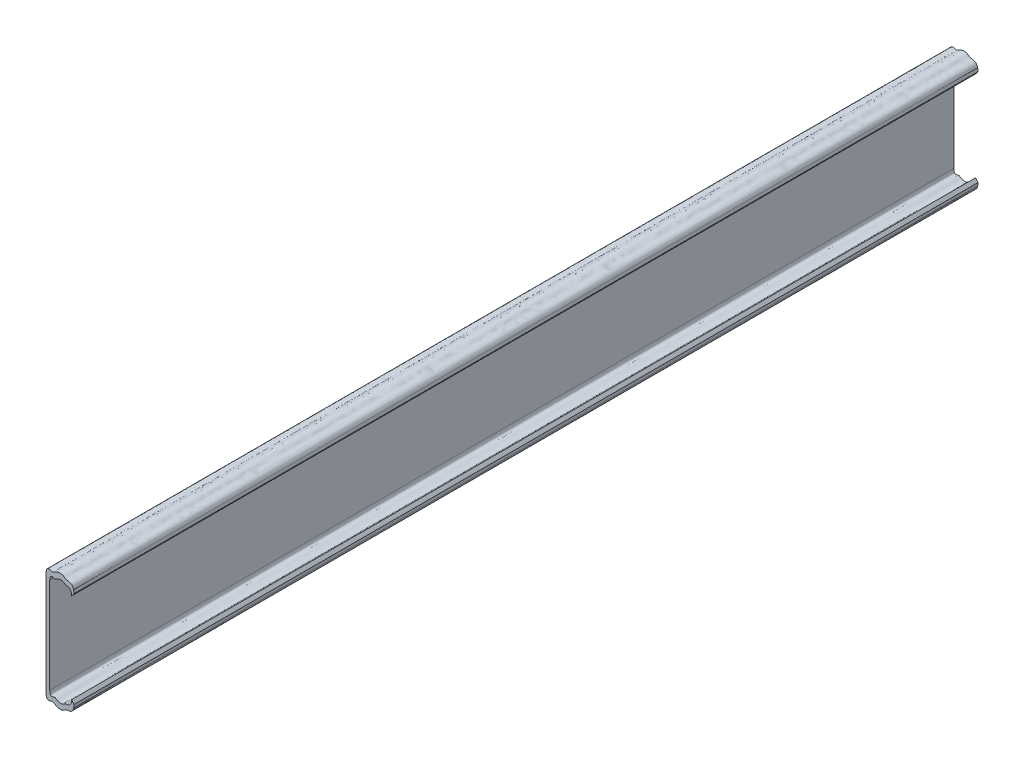
ISO-10303-21;
HEADER;
FILE_DESCRIPTION(('STEP AP214'),'2;1');
FILE_NAME('part.step','',(''),(''),'','','');
FILE_SCHEMA(('AUTOMOTIVE_DESIGN { 1 0 10303 214 1 1 1 1 }'));
ENDSEC;
DATA;
#1=APPLICATION_CONTEXT('core data for automotive mechanical design processes');
#2=APPLICATION_PROTOCOL_DEFINITION('international standard','automotive_design',2000,#1);
#3=PRODUCT_CONTEXT('',#1,'mechanical');
#4=PRODUCT('Part','Part','',(#3));
#5=PRODUCT_RELATED_PRODUCT_CATEGORY('part','',(#4));
#6=PRODUCT_DEFINITION_FORMATION('','',#4);
#7=PRODUCT_DEFINITION_CONTEXT('part definition',#1,'design');
#8=PRODUCT_DEFINITION('design','',#6,#7);
#9=PRODUCT_DEFINITION_SHAPE('','',#8);
#10=(LENGTH_UNIT() NAMED_UNIT(*) SI_UNIT(.MILLI.,.METRE.));
#11=(NAMED_UNIT(*) PLANE_ANGLE_UNIT() SI_UNIT($,.RADIAN.));
#12=(NAMED_UNIT(*) SI_UNIT($,.STERADIAN.) SOLID_ANGLE_UNIT());
#13=UNCERTAINTY_MEASURE_WITH_UNIT(LENGTH_MEASURE(1.E-05),#10,'distance_accuracy_value','');
#14=(GEOMETRIC_REPRESENTATION_CONTEXT(3) GLOBAL_UNCERTAINTY_ASSIGNED_CONTEXT((#13)) GLOBAL_UNIT_ASSIGNED_CONTEXT((#10,
#11,#12)) REPRESENTATION_CONTEXT('',''));
#15=CARTESIAN_POINT('',(0.,0.,0.));
#16=DIRECTION('',(0.,0.,1.));
#17=DIRECTION('',(1.,0.,0.));
#18=AXIS2_PLACEMENT_3D('',#15,#16,#17);
#19=CARTESIAN_POINT('',(1.4303438781,3954.7290134696,346.));
#20=CARTESIAN_POINT('',(1.49225374384663,3955.77746448599,346.));
#21=CARTESIAN_POINT('',(1.67074265915312,3956.0853036269,346.));
#22=CARTESIAN_POINT('',(1.95280531093384,3956.24341615377,346.));
#23=CARTESIAN_POINT('',(2.01218805764632,3956.26460522119,346.));
#24=CARTESIAN_POINT('',(2.25690998711431,3956.32860316862,346.));
#25=CARTESIAN_POINT('',(2.45639926607912,3956.32067254284,346.));
#26=CARTESIAN_POINT('',(2.75790433869258,3956.25941486374,346.));
#27=CARTESIAN_POINT('',(2.86747597615551,3956.22053986312,346.));
#28=CARTESIAN_POINT('',(3.06558290014947,3956.14222097741,346.));
#29=CARTESIAN_POINT('',(3.15726891049071,3956.10455305321,346.));
#30=CARTESIAN_POINT('',(3.35300276320374,3956.0750713278,346.));
#31=CARTESIAN_POINT('',(3.4575650783039,3956.08480291435,346.));
#32=CARTESIAN_POINT('',(3.82696295161048,3956.23664140706,346.));
#33=CARTESIAN_POINT('',(4.13936718021687,3956.47693410221,346.));
#34=CARTESIAN_POINT('',(4.67975367585937,3956.73244660637,346.));
#35=CARTESIAN_POINT('',(4.87237531123399,3956.79870044436,346.));
#36=CARTESIAN_POINT('',(5.25945523692549,3956.89126990318,346.));
#37=CARTESIAN_POINT('',(5.45387712524793,3956.91768379151,346.));
#38=CARTESIAN_POINT('',(5.82111238319273,3956.92926877996,346.));
#39=CARTESIAN_POINT('',(5.99223886047815,3956.91358975771,346.));
#40=CARTESIAN_POINT('',(6.38080961523541,3956.8295198748,346.));
#41=CARTESIAN_POINT('',(6.58050411269036,3956.73963673266,346.));
#42=CARTESIAN_POINT('',(6.80082064641727,3956.58965072797,346.));
#43=CARTESIAN_POINT('',(6.85125983036742,3956.54949734534,346.));
#44=CARTESIAN_POINT('',(7.05761493562505,3956.38491741419,346.));
#45=CARTESIAN_POINT('',(7.22447398202123,3956.25287029291,346.));
#46=CARTESIAN_POINT('',(7.69412707282574,3956.12932011518,346.));
#47=CARTESIAN_POINT('',(7.83348973176185,3956.10436346912,346.));
#48=CARTESIAN_POINT('',(7.99665305390573,3956.0818615527,346.));
#49=B_SPLINE_CURVE_WITH_KNOTS('',3,(#19,#20,#21,#22,#23,#24,#25,#26,#27,#28,#29,#30,#31,#32,#33,
#34,#35,#36,#37,#38,#39,#40,#41,#42,#43,#44,#45,#46,#47,#48),.UNSPECIFIED.,.F.,.F.,(4,2,2,2,2,2,
2,2,2,2,2,2,2,2,4),(0.,0.124999999999758,0.156249999999776,0.24999999999983,0.312499999999866,
0.374999999999902,0.437499999999938,0.56250000000001,0.625000000000046,0.687500000000082,
0.750000000000118,0.843750000000172,0.875000000000189,0.968750000000047,1.),.UNSPECIFIED.);
#50=DIRECTION('',(0.,0.,-1.));
#51=VECTOR('',#50,1.);
#52=SURFACE_OF_LINEAR_EXTRUSION('',#49,#51);
#53=CARTESIAN_POINT('',(1.4303438781,3954.7290134696,0.));
#54=CARTESIAN_POINT('',(1.49225374384663,3955.77746448599,0.));
#55=CARTESIAN_POINT('',(1.67074265915312,3956.0853036269,0.));
#56=CARTESIAN_POINT('',(1.95280531093384,3956.24341615377,0.));
#57=CARTESIAN_POINT('',(2.01218805764632,3956.26460522119,0.));
#58=CARTESIAN_POINT('',(2.25690998711431,3956.32860316862,0.));
#59=CARTESIAN_POINT('',(2.45639926607912,3956.32067254284,0.));
#60=CARTESIAN_POINT('',(2.75790433869258,3956.25941486374,0.));
#61=CARTESIAN_POINT('',(2.86747597615551,3956.22053986312,0.));
#62=CARTESIAN_POINT('',(3.06558290014947,3956.14222097741,0.));
#63=CARTESIAN_POINT('',(3.15726891049071,3956.10455305321,0.));
#64=CARTESIAN_POINT('',(3.35300276320374,3956.0750713278,0.));
#65=CARTESIAN_POINT('',(3.4575650783039,3956.08480291435,0.));
#66=CARTESIAN_POINT('',(3.82696295161048,3956.23664140706,0.));
#67=CARTESIAN_POINT('',(4.13936718021687,3956.47693410221,0.));
#68=CARTESIAN_POINT('',(4.67975367585937,3956.73244660637,0.));
#69=CARTESIAN_POINT('',(4.87237531123399,3956.79870044436,0.));
#70=CARTESIAN_POINT('',(5.25945523692549,3956.89126990318,0.));
#71=CARTESIAN_POINT('',(5.45387712524793,3956.91768379151,0.));
#72=CARTESIAN_POINT('',(5.82111238319273,3956.92926877996,0.));
#73=CARTESIAN_POINT('',(5.99223886047815,3956.91358975771,0.));
#74=CARTESIAN_POINT('',(6.38080961523541,3956.8295198748,0.));
#75=CARTESIAN_POINT('',(6.58050411269036,3956.73963673266,0.));
#76=CARTESIAN_POINT('',(6.80082064641727,3956.58965072797,0.));
#77=CARTESIAN_POINT('',(6.85125983036742,3956.54949734534,0.));
#78=CARTESIAN_POINT('',(7.05761493562505,3956.38491741419,0.));
#79=CARTESIAN_POINT('',(7.22447398202123,3956.25287029291,0.));
#80=CARTESIAN_POINT('',(7.69412707282574,3956.12932011518,0.));
#81=CARTESIAN_POINT('',(7.83348973176185,3956.10436346912,0.));
#82=CARTESIAN_POINT('',(7.99665305390573,3956.0818615527,0.));
#83=B_SPLINE_CURVE_WITH_KNOTS('',3,(#53,#54,#55,#56,#57,#58,#59,#60,#61,#62,#63,#64,#65,#66,#67,
#68,#69,#70,#71,#72,#73,#74,#75,#76,#77,#78,#79,#80,#81,#82),.UNSPECIFIED.,.F.,.F.,(4,2,2,2,2,2,
2,2,2,2,2,2,2,2,4),(0.,0.124999999999758,0.156249999999776,0.24999999999983,0.312499999999866,
0.374999999999902,0.437499999999938,0.56250000000001,0.625000000000046,0.687500000000082,
0.750000000000118,0.843750000000172,0.875000000000189,0.968750000000047,1.),.UNSPECIFIED.);
#84=CARTESIAN_POINT('',(1.4303438781,3954.7290134696,0.));
#85=VERTEX_POINT('',#84);
#86=CARTESIAN_POINT('',(7.99665305390573,3956.0818615527,0.));
#87=VERTEX_POINT('',#86);
#88=EDGE_CURVE('E312',#85,#87,#83,.T.);
#89=ORIENTED_EDGE('',*,*,#88,.T.);
#90=DIRECTION('',(0.,0.,-1.));
#91=VECTOR('',#90,1.);
#92=CARTESIAN_POINT('',(7.99665305390573,3956.0818615527,346.));
#93=LINE('',#92,#91);
#94=CARTESIAN_POINT('',(7.99665305390573,3956.0818615527,346.));
#95=VERTEX_POINT('',#94);
#96=EDGE_CURVE('E11',#95,#87,#93,.T.);
#97=ORIENTED_EDGE('',*,*,#96,.F.);
#98=CARTESIAN_POINT('',(1.4303438781,3954.7290134696,346.));
#99=VERTEX_POINT('',#98);
#100=EDGE_CURVE('E246',#99,#95,#49,.T.);
#101=ORIENTED_EDGE('',*,*,#100,.F.);
#102=DIRECTION('',(0.,0.,-1.));
#103=VECTOR('',#102,1.);
#104=CARTESIAN_POINT('',(1.4303438781,3954.7290134696,346.));
#105=LINE('',#104,#103);
#106=EDGE_CURVE('E158',#99,#85,#105,.T.);
#107=ORIENTED_EDGE('',*,*,#106,.T.);
#108=EDGE_LOOP('',(#89,#97,#101,#107));
#109=FACE_BOUND('',#108,.T.);
#110=ADVANCED_FACE('F41',(#109),#52,.F.);
#111=CARTESIAN_POINT('',(7.99665305390573,3956.0818615527,346.));
#112=CARTESIAN_POINT('',(8.08813068826407,3956.0693209082,346.));
#113=CARTESIAN_POINT('',(8.27275941401864,3956.04401020543,346.));
#114=CARTESIAN_POINT('',(8.54804329715297,3955.98416982031,346.));
#115=CARTESIAN_POINT('',(8.80734903983867,3955.88761999486,346.));
#116=CARTESIAN_POINT('',(9.1144343791744,3955.70596587339,346.));
#117=CARTESIAN_POINT('',(9.39349914253424,3955.39517867725,346.));
#118=CARTESIAN_POINT('',(9.58119185863487,3954.99385688315,346.));
#119=CARTESIAN_POINT('',(9.6679937161165,3954.67444356862,346.));
#120=CARTESIAN_POINT('',(9.71301303772911,3954.43205680597,346.));
#121=CARTESIAN_POINT('',(9.74377818261847,3954.20996294607,346.));
#122=CARTESIAN_POINT('',(9.76600800121297,3953.93847563136,346.));
#123=CARTESIAN_POINT('',(9.77000773691653,3953.75199828866,346.));
#124=CARTESIAN_POINT('',(9.77215865061568,3953.65171749494,346.));
#125=B_SPLINE_CURVE_WITH_KNOTS('',3,(#111,#112,#113,#114,#115,#116,#117,#118,#119,#120,#121,
#122,#123,#124),.UNSPECIFIED.,.F.,.F.,(4,1,1,1,1,1,1,1,1,1,1,4),(0.,0.060950833195839,
0.123016677743811,0.186644705279015,0.24715033662554,0.37168747916435,0.497525342586824,
0.623449375183771,0.683912365851527,0.749156721838359,0.865105526133175,1.),.UNSPECIFIED.);
#126=DIRECTION('',(0.,0.,-1.));
#127=VECTOR('',#126,1.);
#128=SURFACE_OF_LINEAR_EXTRUSION('',#125,#127);
#129=CARTESIAN_POINT('',(7.99665305390573,3956.0818615527,0.));
#130=CARTESIAN_POINT('',(8.08813068826407,3956.0693209082,0.));
#131=CARTESIAN_POINT('',(8.27275941401864,3956.04401020543,0.));
#132=CARTESIAN_POINT('',(8.54804329715297,3955.98416982031,0.));
#133=CARTESIAN_POINT('',(8.80734903983867,3955.88761999486,0.));
#134=CARTESIAN_POINT('',(9.1144343791744,3955.70596587339,0.));
#135=CARTESIAN_POINT('',(9.39349914253424,3955.39517867725,0.));
#136=CARTESIAN_POINT('',(9.58119185863487,3954.99385688315,0.));
#137=CARTESIAN_POINT('',(9.6679937161165,3954.67444356862,0.));
#138=CARTESIAN_POINT('',(9.71301303772911,3954.43205680597,0.));
#139=CARTESIAN_POINT('',(9.74377818261847,3954.20996294607,0.));
#140=CARTESIAN_POINT('',(9.76600800121297,3953.93847563136,0.));
#141=CARTESIAN_POINT('',(9.77000773691653,3953.75199828866,0.));
#142=CARTESIAN_POINT('',(9.77215865061568,3953.65171749494,0.));
#143=B_SPLINE_CURVE_WITH_KNOTS('',3,(#129,#130,#131,#132,#133,#134,#135,#136,#137,#138,#139,
#140,#141,#142),.UNSPECIFIED.,.F.,.F.,(4,1,1,1,1,1,1,1,1,1,1,4),(0.,0.060950833195839,
0.123016677743811,0.186644705279015,0.24715033662554,0.37168747916435,0.497525342586824,
0.623449375183771,0.683912365851527,0.749156721838359,0.865105526133175,1.),.UNSPECIFIED.);
#144=CARTESIAN_POINT('',(9.77215865061568,3953.65171749494,0.));
#145=VERTEX_POINT('',#144);
#146=EDGE_CURVE('E309',#87,#145,#143,.T.);
#147=ORIENTED_EDGE('',*,*,#146,.T.);
#148=DIRECTION('',(0.,0.,-1.));
#149=VECTOR('',#148,1.);
#150=CARTESIAN_POINT('',(9.77215865061568,3953.65171749494,346.));
#151=LINE('',#150,#149);
#152=CARTESIAN_POINT('',(9.77215865061568,3953.65171749494,346.));
#153=VERTEX_POINT('',#152);
#154=EDGE_CURVE('E50',#153,#145,#151,.T.);
#155=ORIENTED_EDGE('',*,*,#154,.F.);
#156=EDGE_CURVE('E113',#95,#153,#125,.T.);
#157=ORIENTED_EDGE('',*,*,#156,.F.);
#158=ORIENTED_EDGE('',*,*,#96,.T.);
#159=EDGE_LOOP('',(#147,#155,#157,#158));
#160=FACE_BOUND('',#159,.T.);
#161=ADVANCED_FACE('F238',(#160),#128,.F.);
#162=CARTESIAN_POINT('',(9.77215865061568,3953.65171749494,346.));
#163=DIRECTION('',(-0.783047503869598,0.621961901311963,0.));
#164=DIRECTION('',(-0.621961901311963,-0.783047503869598,0.));
#165=AXIS2_PLACEMENT_3D('',#162,#163,#164);
#166=PLANE('',#165);
#167=CARTESIAN_POINT('',(9.77215865061568,3953.65171749494,0.));
#168=CARTESIAN_POINT('',(9.90240879056573,3953.81570189133,0.));
#169=CARTESIAN_POINT('',(10.0416133217018,3953.99095982981,0.));
#170=CARTESIAN_POINT('',(10.3506145977149,3954.37999117942,0.));
#171=CARTESIAN_POINT('',(10.5158776945185,3954.58805674608,0.));
#172=CARTESIAN_POINT('',(10.6926331257769,3954.81059111506,0.));
#173=B_SPLINE_CURVE_WITH_KNOTS('',3,(#167,#168,#169,#170,#171,#172),.UNSPECIFIED.,.F.,.F.,(4,2,
4),(0.,0.5,1.),.UNSPECIFIED.);
#174=CARTESIAN_POINT('',(10.6926331257769,3954.81059111506,0.));
#175=VERTEX_POINT('',#174);
#176=EDGE_CURVE('E305',#145,#175,#173,.T.);
#177=ORIENTED_EDGE('',*,*,#176,.T.);
#178=DIRECTION('',(0.,0.,-1.));
#179=VECTOR('',#178,1.);
#180=CARTESIAN_POINT('',(10.6926331257769,3954.81059111506,346.));
#181=LINE('',#180,#179);
#182=CARTESIAN_POINT('',(10.6926331257769,3954.81059111506,346.));
#183=VERTEX_POINT('',#182);
#184=EDGE_CURVE('E270',#183,#175,#181,.T.);
#185=ORIENTED_EDGE('',*,*,#184,.F.);
#186=CARTESIAN_POINT('',(9.77215865061568,3953.65171749494,346.));
#187=CARTESIAN_POINT('',(9.90240879056573,3953.81570189133,346.));
#188=CARTESIAN_POINT('',(10.0416133217018,3953.99095982981,346.));
#189=CARTESIAN_POINT('',(10.3506145977149,3954.37999117942,346.));
#190=CARTESIAN_POINT('',(10.5158776945185,3954.58805674608,346.));
#191=CARTESIAN_POINT('',(10.6926331257769,3954.81059111506,346.));
#192=B_SPLINE_CURVE_WITH_KNOTS('',3,(#186,#187,#188,#189,#190,#191),.UNSPECIFIED.,.F.,.F.,(4,2,
4),(0.,0.5,1.),.UNSPECIFIED.);
#193=EDGE_CURVE('E245',#153,#183,#192,.T.);
#194=ORIENTED_EDGE('',*,*,#193,.F.);
#195=ORIENTED_EDGE('',*,*,#154,.T.);
#196=EDGE_LOOP('',(#177,#185,#194,#195));
#197=FACE_BOUND('',#196,.T.);
#198=ADVANCED_FACE('F235',(#197),#166,.F.);
#199=CARTESIAN_POINT('',(10.6926331257769,3954.81059111506,346.));
#200=CARTESIAN_POINT('',(10.6919132811915,3954.8621788334,346.));
#201=CARTESIAN_POINT('',(10.690503498795,3954.96321099876,346.));
#202=CARTESIAN_POINT('',(10.6847153171319,3955.11728592769,346.));
#203=CARTESIAN_POINT('',(10.676302075218,3955.26777763561,346.));
#204=CARTESIAN_POINT('',(10.6597098035179,3955.47831693335,346.));
#205=CARTESIAN_POINT('',(10.6299822498513,3955.74672256545,346.));
#206=CARTESIAN_POINT('',(10.5845757587491,3955.97356909591,346.));
#207=CARTESIAN_POINT('',(10.562899515935,3956.0818615527,346.));
#208=B_SPLINE_CURVE_WITH_KNOTS('',3,(#199,#200,#201,#202,#203,#204,#205,#206,#207),
.UNSPECIFIED.,.F.,.F.,(4,1,1,1,1,1,4),(0.,0.133575650747692,0.261601746872548,0.383626032686146,
0.499198606756912,0.760926415187611,1.),.UNSPECIFIED.);
#209=DIRECTION('',(0.,0.,-1.));
#210=VECTOR('',#209,1.);
#211=SURFACE_OF_LINEAR_EXTRUSION('',#208,#210);
#212=CARTESIAN_POINT('',(10.6926331257769,3954.81059111506,0.));
#213=CARTESIAN_POINT('',(10.6919132811915,3954.8621788334,0.));
#214=CARTESIAN_POINT('',(10.690503498795,3954.96321099876,0.));
#215=CARTESIAN_POINT('',(10.6847153171319,3955.11728592769,0.));
#216=CARTESIAN_POINT('',(10.676302075218,3955.26777763561,0.));
#217=CARTESIAN_POINT('',(10.6597098035179,3955.47831693335,0.));
#218=CARTESIAN_POINT('',(10.6299822498513,3955.74672256545,0.));
#219=CARTESIAN_POINT('',(10.5845757587491,3955.97356909591,0.));
#220=CARTESIAN_POINT('',(10.562899515935,3956.0818615527,0.));
#221=B_SPLINE_CURVE_WITH_KNOTS('',3,(#212,#213,#214,#215,#216,#217,#218,#219,#220),
.UNSPECIFIED.,.F.,.F.,(4,1,1,1,1,1,4),(0.,0.133575650747692,0.261601746872548,0.383626032686146,
0.499198606756912,0.760926415187611,1.),.UNSPECIFIED.);
#222=CARTESIAN_POINT('',(10.562899515935,3956.0818615527,0.));
#223=VERTEX_POINT('',#222);
#224=EDGE_CURVE('E268',#175,#223,#221,.T.);
#225=ORIENTED_EDGE('',*,*,#224,.T.);
#226=DIRECTION('',(0.,0.,-1.));
#227=VECTOR('',#226,1.);
#228=CARTESIAN_POINT('',(10.562899515935,3956.0818615527,346.));
#229=LINE('',#228,#227);
#230=CARTESIAN_POINT('',(10.562899515935,3956.0818615527,346.));
#231=VERTEX_POINT('',#230);
#232=EDGE_CURVE('E266',#231,#223,#229,.T.);
#233=ORIENTED_EDGE('',*,*,#232,.F.);
#234=EDGE_CURVE('E218',#183,#231,#208,.T.);
#235=ORIENTED_EDGE('',*,*,#234,.F.);
#236=ORIENTED_EDGE('',*,*,#184,.T.);
#237=EDGE_LOOP('',(#225,#233,#235,#236));
#238=FACE_BOUND('',#237,.T.);
#239=ADVANCED_FACE('F231',(#238),#211,.F.);
#240=CARTESIAN_POINT('',(10.562899515935,3956.0818615527,346.));
#241=CARTESIAN_POINT('',(10.2168502117123,3957.61813396205,346.));
#242=CARTESIAN_POINT('',(9.25072388749357,3957.80849084177,346.));
#243=CARTESIAN_POINT('',(8.40659988172503,3957.92725493996,346.));
#244=CARTESIAN_POINT('',(8.29291249523391,3957.94194890807,346.));
#245=CARTESIAN_POINT('',(7.46635040946455,3958.08302700597,346.));
#246=CARTESIAN_POINT('',(7.21780154052773,3958.31226400615,346.));
#247=CARTESIAN_POINT('',(6.88934888103854,3958.57151148814,346.));
#248=CARTESIAN_POINT('',(6.81435088981488,3958.62661079262,346.));
#249=CARTESIAN_POINT('',(6.40237667803227,3958.87921950258,346.));
#250=CARTESIAN_POINT('',(5.97489361434852,3959.01119485891,346.));
#251=CARTESIAN_POINT('',(5.20066255786374,3959.00304381159,346.));
#252=CARTESIAN_POINT('',(4.92380843966438,3958.96768319007,346.));
#253=CARTESIAN_POINT('',(4.37345198280202,3958.83430194924,346.));
#254=CARTESIAN_POINT('',(4.10034641988014,3958.73521023057,346.));
#255=CARTESIAN_POINT('',(3.59664282650134,3958.48171875679,346.));
#256=CARTESIAN_POINT('',(3.36411457673942,3958.33252964448,346.));
#257=CARTESIAN_POINT('',(2.94570594399699,3958.08071975368,346.));
#258=CARTESIAN_POINT('',(2.76022081222523,3957.97928624198,346.));
#259=CARTESIAN_POINT('',(2.28319299694017,3957.87437495152,346.));
#260=CARTESIAN_POINT('',(2.05971670334594,3958.03757279171,346.));
#261=CARTESIAN_POINT('',(1.4259811712272,3958.23197518268,346.));
#262=CARTESIAN_POINT('',(1.02874079358337,3958.27089776711,346.));
#263=CARTESIAN_POINT('',(0.359991505849862,3958.00496206282,346.));
#264=CARTESIAN_POINT('',(0.0880380924219619,3957.68241703242,346.));
#265=CARTESIAN_POINT('',(0.,3956.19148135761,346.));
#266=B_SPLINE_CURVE_WITH_KNOTS('',3,(#240,#241,#242,#243,#244,#245,#246,#247,#248,#249,#250,
#251,#252,#253,#254,#255,#256,#257,#258,#259,#260,#261,#262,#263,#264,#265),.UNSPECIFIED.,.F.,
.F.,(4,2,2,2,2,2,2,2,2,2,2,2,4),(0.,0.0937500000000941,0.10937500000011,0.21875000000016,
0.250000000000171,0.375000000000143,0.437500000000128,0.500000000000114,0.5625000000001,
0.625000000000086,0.750000000000057,0.875000000000029,1.),.UNSPECIFIED.);
#267=DIRECTION('',(0.,0.,-1.));
#268=VECTOR('',#267,1.);
#269=SURFACE_OF_LINEAR_EXTRUSION('',#266,#268);
#270=CARTESIAN_POINT('',(10.562899515935,3956.0818615527,0.));
#271=CARTESIAN_POINT('',(10.2168502117123,3957.61813396205,0.));
#272=CARTESIAN_POINT('',(9.25072388749357,3957.80849084177,0.));
#273=CARTESIAN_POINT('',(8.40659988172503,3957.92725493996,0.));
#274=CARTESIAN_POINT('',(8.29291249523391,3957.94194890807,0.));
#275=CARTESIAN_POINT('',(7.46635040946455,3958.08302700597,0.));
#276=CARTESIAN_POINT('',(7.21780154052773,3958.31226400615,0.));
#277=CARTESIAN_POINT('',(6.88934888103854,3958.57151148814,0.));
#278=CARTESIAN_POINT('',(6.81435088981488,3958.62661079262,0.));
#279=CARTESIAN_POINT('',(6.40237667803227,3958.87921950258,0.));
#280=CARTESIAN_POINT('',(5.97489361434852,3959.01119485891,0.));
#281=CARTESIAN_POINT('',(5.20066255786374,3959.00304381159,0.));
#282=CARTESIAN_POINT('',(4.92380843966438,3958.96768319007,0.));
#283=CARTESIAN_POINT('',(4.37345198280202,3958.83430194924,0.));
#284=CARTESIAN_POINT('',(4.10034641988014,3958.73521023057,0.));
#285=CARTESIAN_POINT('',(3.59664282650134,3958.48171875679,0.));
#286=CARTESIAN_POINT('',(3.36411457673942,3958.33252964448,0.));
#287=CARTESIAN_POINT('',(2.94570594399699,3958.08071975368,0.));
#288=CARTESIAN_POINT('',(2.76022081222523,3957.97928624198,0.));
#289=CARTESIAN_POINT('',(2.28319299694017,3957.87437495152,0.));
#290=CARTESIAN_POINT('',(2.05971670334594,3958.03757279171,0.));
#291=CARTESIAN_POINT('',(1.4259811712272,3958.23197518268,0.));
#292=CARTESIAN_POINT('',(1.02874079358337,3958.27089776711,0.));
#293=CARTESIAN_POINT('',(0.359991505849862,3958.00496206282,0.));
#294=CARTESIAN_POINT('',(0.0880380924219619,3957.68241703242,0.));
#295=CARTESIAN_POINT('',(0.,3956.19148135761,0.));
#296=B_SPLINE_CURVE_WITH_KNOTS('',3,(#270,#271,#272,#273,#274,#275,#276,#277,#278,#279,#280,
#281,#282,#283,#284,#285,#286,#287,#288,#289,#290,#291,#292,#293,#294,#295),.UNSPECIFIED.,.F.,
.F.,(4,2,2,2,2,2,2,2,2,2,2,2,4),(0.,0.0937500000000941,0.10937500000011,0.21875000000016,
0.250000000000171,0.375000000000143,0.437500000000128,0.500000000000114,0.5625000000001,
0.625000000000086,0.750000000000057,0.875000000000029,1.),.UNSPECIFIED.);
#297=CARTESIAN_POINT('',(0.,3956.19148135761,0.));
#298=VERTEX_POINT('',#297);
#299=EDGE_CURVE('E275',#223,#298,#296,.T.);
#300=ORIENTED_EDGE('',*,*,#299,.T.);
#301=DIRECTION('',(0.,0.,-1.));
#302=VECTOR('',#301,1.);
#303=CARTESIAN_POINT('',(0.,3956.19148135761,346.));
#304=LINE('',#303,#302);
#305=CARTESIAN_POINT('',(0.,3956.19148135761,346.));
#306=VERTEX_POINT('',#305);
#307=EDGE_CURVE('E271',#306,#298,#304,.T.);
#308=ORIENTED_EDGE('',*,*,#307,.F.);
#309=EDGE_CURVE('E213',#231,#306,#266,.T.);
#310=ORIENTED_EDGE('',*,*,#309,.F.);
#311=ORIENTED_EDGE('',*,*,#232,.T.);
#312=EDGE_LOOP('',(#300,#308,#310,#311));
#313=FACE_BOUND('',#312,.T.);
#314=ADVANCED_FACE('F227',(#313),#269,.F.);
#315=CARTESIAN_POINT('',(0.,3956.19148135761,346.));
#316=DIRECTION('',(1.,0.,0.));
#317=DIRECTION('',(0.,0.,-1.));
#318=AXIS2_PLACEMENT_3D('',#315,#316,#317);
#319=PLANE('',#318);
#320=DIRECTION('',(0.,-1.,0.));
#321=VECTOR('',#320,1.);
#322=CARTESIAN_POINT('',(0.,3956.19148135761,0.));
#323=LINE('',#322,#321);
#324=CARTESIAN_POINT('',(0.,3916.7079175619,0.));
#325=VERTEX_POINT('',#324);
#326=EDGE_CURVE('E330',#298,#325,#323,.T.);
#327=ORIENTED_EDGE('',*,*,#326,.T.);
#328=DIRECTION('',(0.,0.,-1.));
#329=VECTOR('',#328,1.);
#330=CARTESIAN_POINT('',(0.,3916.7079175619,346.));
#331=LINE('',#330,#329);
#332=CARTESIAN_POINT('',(0.,3916.7079175619,346.));
#333=VERTEX_POINT('',#332);
#334=EDGE_CURVE('E278',#333,#325,#331,.T.);
#335=ORIENTED_EDGE('',*,*,#334,.F.);
#336=DIRECTION('',(0.,-1.,0.));
#337=VECTOR('',#336,1.);
#338=CARTESIAN_POINT('',(0.,3956.19148135761,346.));
#339=LINE('',#338,#337);
#340=EDGE_CURVE('E208',#306,#333,#339,.T.);
#341=ORIENTED_EDGE('',*,*,#340,.F.);
#342=ORIENTED_EDGE('',*,*,#307,.T.);
#343=EDGE_LOOP('',(#327,#335,#341,#342));
#344=FACE_BOUND('',#343,.T.);
#345=ADVANCED_FACE('F230',(#344),#319,.F.);
#346=CARTESIAN_POINT('',(0.,3916.7079175619,346.));
#347=CARTESIAN_POINT('',(0.0880380924219628,3915.21698188708,346.));
#348=CARTESIAN_POINT('',(0.359991505849869,3914.89443685668,346.));
#349=CARTESIAN_POINT('',(1.02874079358338,3914.62850115239,346.));
#350=CARTESIAN_POINT('',(1.42598117122719,3914.66742373682,346.));
#351=CARTESIAN_POINT('',(2.05971670334594,3914.86182612779,346.));
#352=CARTESIAN_POINT('',(2.28319299694019,3915.02502396798,346.));
#353=CARTESIAN_POINT('',(2.76022081222525,3914.92011267751,346.));
#354=CARTESIAN_POINT('',(2.94570594399698,3914.81867916581,346.));
#355=CARTESIAN_POINT('',(3.36411457673941,3914.56686927502,346.));
#356=CARTESIAN_POINT('',(3.59664282650132,3914.41768016271,346.));
#357=CARTESIAN_POINT('',(4.10034641988011,3914.16418868892,346.));
#358=CARTESIAN_POINT('',(4.373451982802,3914.06509697025,346.));
#359=CARTESIAN_POINT('',(4.92380843966436,3913.93171572942,346.));
#360=CARTESIAN_POINT('',(5.20066255786373,3913.89635510791,346.));
#361=CARTESIAN_POINT('',(5.97489361434852,3913.88820406059,346.));
#362=CARTESIAN_POINT('',(6.40237667803233,3914.02017941691,346.));
#363=CARTESIAN_POINT('',(6.81435088981497,3914.27278812688,346.));
#364=CARTESIAN_POINT('',(6.88934888103863,3914.32788743136,346.));
#365=CARTESIAN_POINT('',(7.21780154052781,3914.58713491334,346.));
#366=CARTESIAN_POINT('',(7.4663504094643,3914.81637191352,346.));
#367=CARTESIAN_POINT('',(8.29291249523419,3914.95745001142,346.));
#368=CARTESIAN_POINT('',(8.4065998817253,3914.97214397953,346.));
#369=CARTESIAN_POINT('',(9.25072388749369,3915.09090807773,346.));
#370=CARTESIAN_POINT('',(10.2168502117124,3915.28126495744,346.));
#371=CARTESIAN_POINT('',(10.562899515935,3916.8175373668,346.));
#372=B_SPLINE_CURVE_WITH_KNOTS('',3,(#346,#347,#348,#349,#350,#351,#352,#353,#354,#355,#356,
#357,#358,#359,#360,#361,#362,#363,#364,#365,#366,#367,#368,#369,#370,#371),.UNSPECIFIED.,.F.,
.F.,(4,2,2,2,2,2,2,2,2,2,2,2,4),(0.,0.124999999999979,0.249999999999958,0.374999999999937,
0.437499999999945,0.499999999999953,0.562499999999961,0.624999999999968,0.749999999999985,
0.781249999999989,0.890625000000004,0.906250000000006,1.),.UNSPECIFIED.);
#373=DIRECTION('',(0.,0.,-1.));
#374=VECTOR('',#373,1.);
#375=SURFACE_OF_LINEAR_EXTRUSION('',#372,#374);
#376=CARTESIAN_POINT('',(0.,3916.7079175619,0.));
#377=CARTESIAN_POINT('',(0.0880380924219628,3915.21698188708,0.));
#378=CARTESIAN_POINT('',(0.359991505849869,3914.89443685668,0.));
#379=CARTESIAN_POINT('',(1.02874079358338,3914.62850115239,0.));
#380=CARTESIAN_POINT('',(1.42598117122719,3914.66742373682,0.));
#381=CARTESIAN_POINT('',(2.05971670334594,3914.86182612779,0.));
#382=CARTESIAN_POINT('',(2.28319299694019,3915.02502396798,0.));
#383=CARTESIAN_POINT('',(2.76022081222525,3914.92011267751,0.));
#384=CARTESIAN_POINT('',(2.94570594399698,3914.81867916581,0.));
#385=CARTESIAN_POINT('',(3.36411457673941,3914.56686927502,0.));
#386=CARTESIAN_POINT('',(3.59664282650132,3914.41768016271,0.));
#387=CARTESIAN_POINT('',(4.10034641988011,3914.16418868892,0.));
#388=CARTESIAN_POINT('',(4.373451982802,3914.06509697025,0.));
#389=CARTESIAN_POINT('',(4.92380843966436,3913.93171572942,0.));
#390=CARTESIAN_POINT('',(5.20066255786373,3913.89635510791,0.));
#391=CARTESIAN_POINT('',(5.97489361434852,3913.88820406059,0.));
#392=CARTESIAN_POINT('',(6.40237667803233,3914.02017941691,0.));
#393=CARTESIAN_POINT('',(6.81435088981497,3914.27278812688,0.));
#394=CARTESIAN_POINT('',(6.88934888103863,3914.32788743136,0.));
#395=CARTESIAN_POINT('',(7.21780154052781,3914.58713491334,0.));
#396=CARTESIAN_POINT('',(7.4663504094643,3914.81637191352,0.));
#397=CARTESIAN_POINT('',(8.29291249523419,3914.95745001142,0.));
#398=CARTESIAN_POINT('',(8.4065998817253,3914.97214397953,0.));
#399=CARTESIAN_POINT('',(9.25072388749369,3915.09090807773,0.));
#400=CARTESIAN_POINT('',(10.2168502117124,3915.28126495744,0.));
#401=CARTESIAN_POINT('',(10.562899515935,3916.8175373668,0.));
#402=B_SPLINE_CURVE_WITH_KNOTS('',3,(#376,#377,#378,#379,#380,#381,#382,#383,#384,#385,#386,
#387,#388,#389,#390,#391,#392,#393,#394,#395,#396,#397,#398,#399,#400,#401),.UNSPECIFIED.,.F.,
.F.,(4,2,2,2,2,2,2,2,2,2,2,2,4),(0.,0.124999999999979,0.249999999999958,0.374999999999937,
0.437499999999945,0.499999999999953,0.562499999999961,0.624999999999968,0.749999999999985,
0.781249999999989,0.890625000000004,0.906250000000006,1.),.UNSPECIFIED.);
#403=CARTESIAN_POINT('',(10.562899515935,3916.8175373668,0.));
#404=VERTEX_POINT('',#403);
#405=EDGE_CURVE('E290',#325,#404,#402,.T.);
#406=ORIENTED_EDGE('',*,*,#405,.T.);
#407=DIRECTION('',(0.,0.,-1.));
#408=VECTOR('',#407,1.);
#409=CARTESIAN_POINT('',(10.562899515935,3916.8175373668,346.));
#410=LINE('',#409,#408);
#411=CARTESIAN_POINT('',(10.562899515935,3916.8175373668,346.));
#412=VERTEX_POINT('',#411);
#413=EDGE_CURVE('E288',#412,#404,#410,.T.);
#414=ORIENTED_EDGE('',*,*,#413,.F.);
#415=EDGE_CURVE('E195',#333,#412,#372,.T.);
#416=ORIENTED_EDGE('',*,*,#415,.F.);
#417=ORIENTED_EDGE('',*,*,#334,.T.);
#418=EDGE_LOOP('',(#406,#414,#416,#417));
#419=FACE_BOUND('',#418,.T.);
#420=ADVANCED_FACE('F187',(#419),#375,.F.);
#421=CARTESIAN_POINT('',(10.562899515935,3916.8175373668,346.));
#422=CARTESIAN_POINT('',(10.5741666541767,3916.87046908699,346.));
#423=CARTESIAN_POINT('',(10.5972852661141,3916.97907766817,346.));
#424=CARTESIAN_POINT('',(10.6243490711837,3917.14336302356,346.));
#425=CARTESIAN_POINT('',(10.647212020543,3917.31252949583,346.));
#426=CARTESIAN_POINT('',(10.6694772743891,3917.52761427965,346.));
#427=CARTESIAN_POINT('',(10.6871023784668,3917.79232209144,346.));
#428=CARTESIAN_POINT('',(10.6907312973827,3917.98685685354,346.));
#429=CARTESIAN_POINT('',(10.6926331257769,3918.08880780444,346.));
#430=B_SPLINE_CURVE_WITH_KNOTS('',3,(#421,#422,#423,#424,#425,#426,#427,#428,#429),
.UNSPECIFIED.,.F.,.F.,(4,1,1,1,1,1,4),(0.,0.116530114593376,0.239103704998411,0.367349581045148,
0.500883136025433,0.738424956320364,1.),.UNSPECIFIED.);
#431=DIRECTION('',(0.,0.,-1.));
#432=VECTOR('',#431,1.);
#433=SURFACE_OF_LINEAR_EXTRUSION('',#430,#432);
#434=CARTESIAN_POINT('',(10.562899515935,3916.8175373668,0.));
#435=CARTESIAN_POINT('',(10.5741666541767,3916.87046908699,0.));
#436=CARTESIAN_POINT('',(10.5972852661141,3916.97907766817,0.));
#437=CARTESIAN_POINT('',(10.6243490711837,3917.14336302356,0.));
#438=CARTESIAN_POINT('',(10.647212020543,3917.31252949583,0.));
#439=CARTESIAN_POINT('',(10.6694772743891,3917.52761427965,0.));
#440=CARTESIAN_POINT('',(10.6871023784668,3917.79232209144,0.));
#441=CARTESIAN_POINT('',(10.6907312973827,3917.98685685354,0.));
#442=CARTESIAN_POINT('',(10.6926331257769,3918.08880780444,0.));
#443=B_SPLINE_CURVE_WITH_KNOTS('',3,(#434,#435,#436,#437,#438,#439,#440,#441,#442),
.UNSPECIFIED.,.F.,.F.,(4,1,1,1,1,1,4),(0.,0.116530114593376,0.239103704998411,0.367349581045148,
0.500883136025433,0.738424956320364,1.),.UNSPECIFIED.);
#444=CARTESIAN_POINT('',(10.6926331257769,3918.08880780444,0.));
#445=VERTEX_POINT('',#444);
#446=EDGE_CURVE('E295',#404,#445,#443,.T.);
#447=ORIENTED_EDGE('',*,*,#446,.T.);
#448=DIRECTION('',(0.,0.,-1.));
#449=VECTOR('',#448,1.);
#450=CARTESIAN_POINT('',(10.6926331257769,3918.08880780444,346.));
#451=LINE('',#450,#449);
#452=CARTESIAN_POINT('',(10.6926331257769,3918.08880780444,346.));
#453=VERTEX_POINT('',#452);
#454=EDGE_CURVE('E292',#453,#445,#451,.T.);
#455=ORIENTED_EDGE('',*,*,#454,.F.);
#456=EDGE_CURVE('E191',#412,#453,#430,.T.);
#457=ORIENTED_EDGE('',*,*,#456,.F.);
#458=ORIENTED_EDGE('',*,*,#413,.T.);
#459=EDGE_LOOP('',(#447,#455,#457,#458));
#460=FACE_BOUND('',#459,.T.);
#461=ADVANCED_FACE('F182',(#460),#433,.F.);
#462=CARTESIAN_POINT('',(10.6926331257769,3918.08880780444,346.));
#463=DIRECTION('',(-0.783047503868899,-0.621961901312843,0.));
#464=DIRECTION('',(0.621961901312843,-0.783047503868899,0.));
#465=AXIS2_PLACEMENT_3D('',#462,#463,#464);
#466=PLANE('',#465);
#467=CARTESIAN_POINT('',(10.6926331257769,3918.08880780444,0.));
#468=CARTESIAN_POINT('',(10.5158776945186,3918.31134217343,0.));
#469=CARTESIAN_POINT('',(10.3506145977153,3918.51940774008,0.));
#470=CARTESIAN_POINT('',(10.0416133217027,3918.90843908969,0.));
#471=CARTESIAN_POINT('',(9.90240879056548,3919.08369702816,0.));
#472=CARTESIAN_POINT('',(9.77215865061567,3919.24768142456,0.));
#473=B_SPLINE_CURVE_WITH_KNOTS('',3,(#467,#468,#469,#470,#471,#472),.UNSPECIFIED.,.F.,.F.,(4,2,
4),(0.,0.5,1.),.UNSPECIFIED.);
#474=CARTESIAN_POINT('',(9.77215865061567,3919.24768142456,0.));
#475=VERTEX_POINT('',#474);
#476=EDGE_CURVE('E298',#445,#475,#473,.T.);
#477=ORIENTED_EDGE('',*,*,#476,.T.);
#478=DIRECTION('',(0.,0.,-1.));
#479=VECTOR('',#478,1.);
#480=CARTESIAN_POINT('',(9.77215865061567,3919.24768142456,346.));
#481=LINE('',#480,#479);
#482=CARTESIAN_POINT('',(9.77215865061567,3919.24768142456,346.));
#483=VERTEX_POINT('',#482);
#484=EDGE_CURVE('E153',#483,#475,#481,.T.);
#485=ORIENTED_EDGE('',*,*,#484,.F.);
#486=CARTESIAN_POINT('',(10.6926331257769,3918.08880780444,346.));
#487=CARTESIAN_POINT('',(10.5158776945186,3918.31134217343,346.));
#488=CARTESIAN_POINT('',(10.3506145977153,3918.51940774008,346.));
#489=CARTESIAN_POINT('',(10.0416133217027,3918.90843908969,346.));
#490=CARTESIAN_POINT('',(9.90240879056548,3919.08369702816,346.));
#491=CARTESIAN_POINT('',(9.77215865061567,3919.24768142456,346.));
#492=B_SPLINE_CURVE_WITH_KNOTS('',3,(#486,#487,#488,#489,#490,#491),.UNSPECIFIED.,.F.,.F.,(4,2,
4),(0.,0.5,1.),.UNSPECIFIED.);
#493=EDGE_CURVE('E144',#453,#483,#492,.T.);
#494=ORIENTED_EDGE('',*,*,#493,.F.);
#495=ORIENTED_EDGE('',*,*,#454,.T.);
#496=EDGE_LOOP('',(#477,#485,#494,#495));
#497=FACE_BOUND('',#496,.T.);
#498=ADVANCED_FACE('F179',(#497),#466,.F.);
#499=CARTESIAN_POINT('',(9.77215865061567,3919.24768142456,346.));
#500=CARTESIAN_POINT('',(9.77136528888385,3919.19687390877,346.));
#501=CARTESIAN_POINT('',(9.76982467060813,3919.09821149005,346.));
#502=CARTESIAN_POINT('',(9.76269076457917,3918.94368725458,346.));
#503=CARTESIAN_POINT('',(9.7520329231586,3918.7926056754,346.));
#504=CARTESIAN_POINT('',(9.73612742228429,3918.63382381349,346.));
#505=CARTESIAN_POINT('',(9.71299641806282,3918.46732132107,346.));
#506=CARTESIAN_POINT('',(9.66800734030482,3918.22498442138,346.));
#507=CARTESIAN_POINT('',(9.58118815965698,3917.90553584906,346.));
#508=CARTESIAN_POINT('',(9.39350028584127,3917.50422180331,346.));
#509=CARTESIAN_POINT('',(9.11444280678571,3917.19344321095,346.));
#510=CARTESIAN_POINT('',(8.80736330573643,3917.01178471603,346.));
#511=CARTESIAN_POINT('',(8.54805793024615,3916.91523241908,346.));
#512=CARTESIAN_POINT('',(8.2727594555506,3916.85538868943,346.));
#513=CARTESIAN_POINT('',(8.08813070202472,3916.83007800313,346.));
#514=CARTESIAN_POINT('',(7.99665305390574,3916.8175373668,346.));
#515=B_SPLINE_CURVE_WITH_KNOTS('',3,(#499,#500,#501,#502,#503,#504,#505,#506,#507,#508,#509,
#510,#511,#512,#513,#514),.UNSPECIFIED.,.F.,.F.,(4,1,1,1,1,1,1,1,1,1,1,1,1,4),(0.,
0.0694712607612872,0.134905289319321,0.195584025631666,0.250878314681438,0.31610888266129,
0.376579776696723,0.502497915707462,0.628329889577616,0.752861203441373,0.81335399306552,
0.876989079767381,0.939052019466439,1.),.UNSPECIFIED.);
#516=DIRECTION('',(0.,0.,-1.));
#517=VECTOR('',#516,1.);
#518=SURFACE_OF_LINEAR_EXTRUSION('',#515,#517);
#519=CARTESIAN_POINT('',(9.77215865061567,3919.24768142456,0.));
#520=CARTESIAN_POINT('',(9.77136528888385,3919.19687390877,0.));
#521=CARTESIAN_POINT('',(9.76982467060813,3919.09821149005,0.));
#522=CARTESIAN_POINT('',(9.76269076457917,3918.94368725458,0.));
#523=CARTESIAN_POINT('',(9.7520329231586,3918.7926056754,0.));
#524=CARTESIAN_POINT('',(9.73612742228429,3918.63382381349,0.));
#525=CARTESIAN_POINT('',(9.71299641806282,3918.46732132107,0.));
#526=CARTESIAN_POINT('',(9.66800734030482,3918.22498442138,0.));
#527=CARTESIAN_POINT('',(9.58118815965698,3917.90553584906,0.));
#528=CARTESIAN_POINT('',(9.39350028584127,3917.50422180331,0.));
#529=CARTESIAN_POINT('',(9.11444280678571,3917.19344321095,0.));
#530=CARTESIAN_POINT('',(8.80736330573643,3917.01178471603,0.));
#531=CARTESIAN_POINT('',(8.54805793024615,3916.91523241908,0.));
#532=CARTESIAN_POINT('',(8.2727594555506,3916.85538868943,0.));
#533=CARTESIAN_POINT('',(8.08813070202472,3916.83007800313,0.));
#534=CARTESIAN_POINT('',(7.99665305390574,3916.8175373668,0.));
#535=B_SPLINE_CURVE_WITH_KNOTS('',3,(#519,#520,#521,#522,#523,#524,#525,#526,#527,#528,#529,
#530,#531,#532,#533,#534),.UNSPECIFIED.,.F.,.F.,(4,1,1,1,1,1,1,1,1,1,1,1,1,4),(0.,
0.0694712607612872,0.134905289319321,0.195584025631666,0.250878314681438,0.31610888266129,
0.376579776696723,0.502497915707462,0.628329889577616,0.752861203441373,0.81335399306552,
0.876989079767381,0.939052019466439,1.),.UNSPECIFIED.);
#536=CARTESIAN_POINT('',(7.99665305390574,3916.8175373668,0.));
#537=VERTEX_POINT('',#536);
#538=EDGE_CURVE('E152',#475,#537,#535,.T.);
#539=ORIENTED_EDGE('',*,*,#538,.T.);
#540=DIRECTION('',(0.,0.,-1.));
#541=VECTOR('',#540,1.);
#542=CARTESIAN_POINT('',(7.99665305390574,3916.8175373668,346.));
#543=LINE('',#542,#541);
#544=CARTESIAN_POINT('',(7.99665305390574,3916.8175373668,346.));
#545=VERTEX_POINT('',#544);
#546=EDGE_CURVE('E149',#545,#537,#543,.T.);
#547=ORIENTED_EDGE('',*,*,#546,.F.);
#548=EDGE_CURVE('E138',#483,#545,#515,.T.);
#549=ORIENTED_EDGE('',*,*,#548,.F.);
#550=ORIENTED_EDGE('',*,*,#484,.T.);
#551=EDGE_LOOP('',(#539,#547,#549,#550));
#552=FACE_BOUND('',#551,.T.);
#553=ADVANCED_FACE('F150',(#552),#518,.F.);
#554=CARTESIAN_POINT('',(7.99665305390574,3916.8175373668,346.));
#555=CARTESIAN_POINT('',(7.83348973176188,3916.79503545038,346.));
#556=CARTESIAN_POINT('',(7.69412707282574,3916.77007880432,346.));
#557=CARTESIAN_POINT('',(7.22447398202147,3916.64652862658,346.));
#558=CARTESIAN_POINT('',(7.05761493562516,3916.51448150532,346.));
#559=CARTESIAN_POINT('',(6.85125983036742,3916.34990157416,346.));
#560=CARTESIAN_POINT('',(6.80082064641726,3916.30974819152,346.));
#561=CARTESIAN_POINT('',(6.58050411269038,3916.15976218684,346.));
#562=CARTESIAN_POINT('',(6.38080961523544,3916.06987904469,346.));
#563=CARTESIAN_POINT('',(5.99223886047818,3915.98580916179,346.));
#564=CARTESIAN_POINT('',(5.82111238319277,3915.97013013954,346.));
#565=CARTESIAN_POINT('',(5.45387712524793,3915.981715128,346.));
#566=CARTESIAN_POINT('',(5.25945523692547,3916.00812901632,346.));
#567=CARTESIAN_POINT('',(4.87237531123393,3916.10069847514,346.));
#568=CARTESIAN_POINT('',(4.67975367585927,3916.16695231312,346.));
#569=CARTESIAN_POINT('',(4.13936718021679,3916.42246481729,346.));
#570=CARTESIAN_POINT('',(3.82696295161042,3916.66275751243,346.));
#571=CARTESIAN_POINT('',(3.45756507830385,3916.81459600514,346.));
#572=CARTESIAN_POINT('',(3.35300276320369,3916.82432759169,346.));
#573=CARTESIAN_POINT('',(3.15726891049066,3916.79484586629,346.));
#574=CARTESIAN_POINT('',(3.06558290014943,3916.75717794209,346.));
#575=CARTESIAN_POINT('',(2.86747597615547,3916.67885905638,346.));
#576=CARTESIAN_POINT('',(2.75790433869254,3916.63998405576,346.));
#577=CARTESIAN_POINT('',(2.45639926607909,3916.57872637665,346.));
#578=CARTESIAN_POINT('',(2.25690998711428,3916.57079575088,346.));
#579=CARTESIAN_POINT('',(2.0121880576463,3916.63479369831,346.));
#580=CARTESIAN_POINT('',(1.95280531093381,3916.65598276572,346.));
#581=CARTESIAN_POINT('',(1.67074265915311,3916.81409529259,346.));
#582=CARTESIAN_POINT('',(1.49225374384663,3917.1219344335,346.));
#583=CARTESIAN_POINT('',(1.43034387808708,3918.17038544993,346.));
#584=B_SPLINE_CURVE_WITH_KNOTS('',3,(#554,#555,#556,#557,#558,#559,#560,#561,#562,#563,#564,
#565,#566,#567,#568,#569,#570,#571,#572,#573,#574,#575,#576,#577,#578,#579,#580,#581,#582,#583),
.UNSPECIFIED.,.F.,.F.,(4,2,2,2,2,2,2,2,2,2,2,2,2,2,4),(0.,0.0312500000000874,0.125000000000286,
0.156250000000276,0.250000000000245,0.312500000000225,0.375000000000205,0.437500000000184,
0.562500000000143,0.625000000000123,0.687500000000102,0.750000000000082,0.843750000000051,
0.875000000000041,1.),.UNSPECIFIED.);
#585=DIRECTION('',(0.,0.,-1.));
#586=VECTOR('',#585,1.);
#587=SURFACE_OF_LINEAR_EXTRUSION('',#584,#586);
#588=CARTESIAN_POINT('',(7.99665305390574,3916.8175373668,0.));
#589=CARTESIAN_POINT('',(7.83348973176188,3916.79503545038,0.));
#590=CARTESIAN_POINT('',(7.69412707282574,3916.77007880432,0.));
#591=CARTESIAN_POINT('',(7.22447398202147,3916.64652862658,0.));
#592=CARTESIAN_POINT('',(7.05761493562516,3916.51448150532,0.));
#593=CARTESIAN_POINT('',(6.85125983036742,3916.34990157416,0.));
#594=CARTESIAN_POINT('',(6.80082064641726,3916.30974819152,0.));
#595=CARTESIAN_POINT('',(6.58050411269038,3916.15976218684,0.));
#596=CARTESIAN_POINT('',(6.38080961523544,3916.06987904469,0.));
#597=CARTESIAN_POINT('',(5.99223886047818,3915.98580916179,0.));
#598=CARTESIAN_POINT('',(5.82111238319277,3915.97013013954,0.));
#599=CARTESIAN_POINT('',(5.45387712524793,3915.981715128,0.));
#600=CARTESIAN_POINT('',(5.25945523692547,3916.00812901632,0.));
#601=CARTESIAN_POINT('',(4.87237531123393,3916.10069847514,0.));
#602=CARTESIAN_POINT('',(4.67975367585927,3916.16695231312,0.));
#603=CARTESIAN_POINT('',(4.13936718021679,3916.42246481729,0.));
#604=CARTESIAN_POINT('',(3.82696295161042,3916.66275751243,0.));
#605=CARTESIAN_POINT('',(3.45756507830385,3916.81459600514,0.));
#606=CARTESIAN_POINT('',(3.35300276320369,3916.82432759169,0.));
#607=CARTESIAN_POINT('',(3.15726891049066,3916.79484586629,0.));
#608=CARTESIAN_POINT('',(3.06558290014943,3916.75717794209,0.));
#609=CARTESIAN_POINT('',(2.86747597615547,3916.67885905638,0.));
#610=CARTESIAN_POINT('',(2.75790433869254,3916.63998405576,0.));
#611=CARTESIAN_POINT('',(2.45639926607909,3916.57872637665,0.));
#612=CARTESIAN_POINT('',(2.25690998711428,3916.57079575088,0.));
#613=CARTESIAN_POINT('',(2.0121880576463,3916.63479369831,0.));
#614=CARTESIAN_POINT('',(1.95280531093381,3916.65598276572,0.));
#615=CARTESIAN_POINT('',(1.67074265915311,3916.81409529259,0.));
#616=CARTESIAN_POINT('',(1.49225374384663,3917.1219344335,0.));
#617=CARTESIAN_POINT('',(1.43034387808708,3918.17038544993,0.));
#618=B_SPLINE_CURVE_WITH_KNOTS('',3,(#588,#589,#590,#591,#592,#593,#594,#595,#596,#597,#598,
#599,#600,#601,#602,#603,#604,#605,#606,#607,#608,#609,#610,#611,#612,#613,#614,#615,#616,#617),
.UNSPECIFIED.,.F.,.F.,(4,2,2,2,2,2,2,2,2,2,2,2,2,2,4),(0.,0.0312500000000874,0.125000000000286,
0.156250000000276,0.250000000000245,0.312500000000225,0.375000000000205,0.437500000000184,
0.562500000000143,0.625000000000123,0.687500000000102,0.750000000000082,0.843750000000051,
0.875000000000041,1.),.UNSPECIFIED.);
#619=CARTESIAN_POINT('',(1.43034387808708,3918.17038544993,0.));
#620=VERTEX_POINT('',#619);
#621=EDGE_CURVE('E99',#537,#620,#618,.T.);
#622=ORIENTED_EDGE('',*,*,#621,.T.);
#623=DIRECTION('',(0.,0.,-1.));
#624=VECTOR('',#623,1.);
#625=CARTESIAN_POINT('',(1.43034387808708,3918.17038544993,346.));
#626=LINE('',#625,#624);
#627=CARTESIAN_POINT('',(1.43034387808708,3918.17038544993,346.));
#628=VERTEX_POINT('',#627);
#629=EDGE_CURVE('E154',#628,#620,#626,.T.);
#630=ORIENTED_EDGE('',*,*,#629,.F.);
#631=EDGE_CURVE('E142',#545,#628,#584,.T.);
#632=ORIENTED_EDGE('',*,*,#631,.F.);
#633=ORIENTED_EDGE('',*,*,#546,.T.);
#634=EDGE_LOOP('',(#622,#630,#632,#633));
#635=FACE_BOUND('',#634,.T.);
#636=ADVANCED_FACE('F156',(#635),#587,.F.);
#637=CARTESIAN_POINT('',(1.43034387808708,3918.17038544993,346.));
#638=DIRECTION('',(-1.,3.53434702305054E-13,0.));
#639=DIRECTION('',(-3.53434702305054E-13,-1.,0.));
#640=AXIS2_PLACEMENT_3D('',#637,#638,#639);
#641=PLANE('',#640);
#642=DIRECTION('',(3.53434702305054E-13,1.,0.));
#643=VECTOR('',#642,1.);
#644=CARTESIAN_POINT('',(1.43034387808708,3918.17038544993,0.));
#645=LINE('',#644,#643);
#646=EDGE_CURVE('E105',#620,#85,#645,.T.);
#647=ORIENTED_EDGE('',*,*,#646,.T.);
#648=ORIENTED_EDGE('',*,*,#106,.F.);
#649=DIRECTION('',(3.53434702305054E-13,1.,0.));
#650=VECTOR('',#649,1.);
#651=CARTESIAN_POINT('',(1.43034387808708,3918.17038544993,346.));
#652=LINE('',#651,#650);
#653=EDGE_CURVE('E58',#628,#99,#652,.T.);
#654=ORIENTED_EDGE('',*,*,#653,.F.);
#655=ORIENTED_EDGE('',*,*,#629,.T.);
#656=EDGE_LOOP('',(#647,#648,#654,#655));
#657=FACE_BOUND('',#656,.T.);
#658=ADVANCED_FACE('F175',(#657),#641,.F.);
#659=CARTESIAN_POINT('',(3.9974141177752,3956.36542725559,346.));
#660=DIRECTION('',(0.,0.,1.));
#661=DIRECTION('',(1.,0.,0.));
#662=AXIS2_PLACEMENT_3D('',#659,#660,#661);
#663=PLANE('',#662);
#664=ORIENTED_EDGE('',*,*,#100,.T.);
#665=ORIENTED_EDGE('',*,*,#156,.T.);
#666=ORIENTED_EDGE('',*,*,#193,.T.);
#667=ORIENTED_EDGE('',*,*,#234,.T.);
#668=ORIENTED_EDGE('',*,*,#309,.T.);
#669=ORIENTED_EDGE('',*,*,#340,.T.);
#670=ORIENTED_EDGE('',*,*,#415,.T.);
#671=ORIENTED_EDGE('',*,*,#456,.T.);
#672=ORIENTED_EDGE('',*,*,#493,.T.);
#673=ORIENTED_EDGE('',*,*,#548,.T.);
#674=ORIENTED_EDGE('',*,*,#631,.T.);
#675=ORIENTED_EDGE('',*,*,#653,.T.);
#676=EDGE_LOOP('',(#664,#665,#666,#667,#668,#669,#670,#671,#672,#673,#674,#675));
#677=FACE_BOUND('',#676,.T.);
#678=ADVANCED_FACE('F140',(#677),#663,.T.);
#679=CARTESIAN_POINT('',(3.9974141177752,3956.36542725559,0.));
#680=DIRECTION('',(0.,0.,1.));
#681=DIRECTION('',(1.,0.,0.));
#682=AXIS2_PLACEMENT_3D('',#679,#680,#681);
#683=PLANE('',#682);
#684=ORIENTED_EDGE('',*,*,#88,.F.);
#685=ORIENTED_EDGE('',*,*,#646,.F.);
#686=ORIENTED_EDGE('',*,*,#621,.F.);
#687=ORIENTED_EDGE('',*,*,#538,.F.);
#688=ORIENTED_EDGE('',*,*,#476,.F.);
#689=ORIENTED_EDGE('',*,*,#446,.F.);
#690=ORIENTED_EDGE('',*,*,#405,.F.);
#691=ORIENTED_EDGE('',*,*,#326,.F.);
#692=ORIENTED_EDGE('',*,*,#299,.F.);
#693=ORIENTED_EDGE('',*,*,#224,.F.);
#694=ORIENTED_EDGE('',*,*,#176,.F.);
#695=ORIENTED_EDGE('',*,*,#146,.F.);
#696=EDGE_LOOP('',(#684,#685,#686,#687,#688,#689,#690,#691,#692,#693,#694,#695));
#697=FACE_BOUND('',#696,.T.);
#698=ADVANCED_FACE('F308',(#697),#683,.F.);
#699=CLOSED_SHELL('',(#110,#161,#198,#239,#314,#345,#420,#461,#498,#553,#636,#658,#678,#698));
#700=MANIFOLD_SOLID_BREP('B2',#699);
#701=ADVANCED_BREP_SHAPE_REPRESENTATION('',(#18,#700),#14);
#702=SHAPE_DEFINITION_REPRESENTATION(#9,#701);
ENDSEC;
END-ISO-10303-21;
